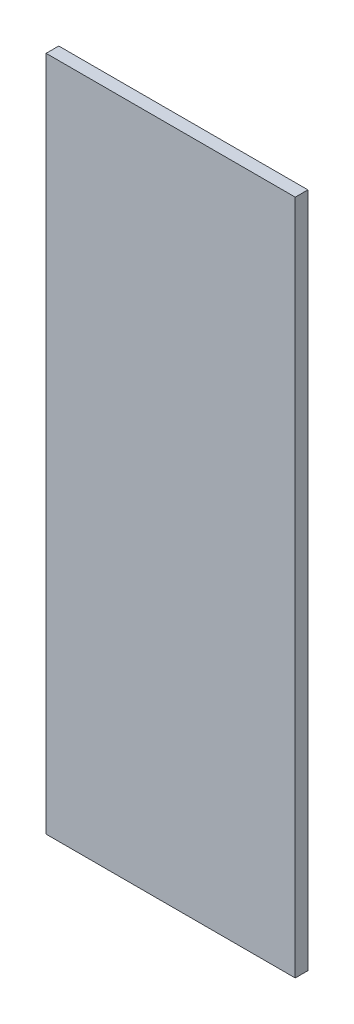
ISO-10303-21;
HEADER;
FILE_DESCRIPTION(('STEP AP214'),'2;1');
FILE_NAME('part.step','',(''),(''),'','','');
FILE_SCHEMA(('AUTOMOTIVE_DESIGN { 1 0 10303 214 1 1 1 1 }'));
ENDSEC;
DATA;
#1=APPLICATION_CONTEXT('core data for automotive mechanical design processes');
#2=APPLICATION_PROTOCOL_DEFINITION('international standard','automotive_design',2000,#1);
#3=PRODUCT_CONTEXT('',#1,'mechanical');
#4=PRODUCT('Part','Part','',(#3));
#5=PRODUCT_RELATED_PRODUCT_CATEGORY('part','',(#4));
#6=PRODUCT_DEFINITION_FORMATION('','',#4);
#7=PRODUCT_DEFINITION_CONTEXT('part definition',#1,'design');
#8=PRODUCT_DEFINITION('design','',#6,#7);
#9=PRODUCT_DEFINITION_SHAPE('','',#8);
#10=(LENGTH_UNIT() NAMED_UNIT(*) SI_UNIT(.MILLI.,.METRE.));
#11=(NAMED_UNIT(*) PLANE_ANGLE_UNIT() SI_UNIT($,.RADIAN.));
#12=(NAMED_UNIT(*) SI_UNIT($,.STERADIAN.) SOLID_ANGLE_UNIT());
#13=UNCERTAINTY_MEASURE_WITH_UNIT(LENGTH_MEASURE(1.E-05),#10,'distance_accuracy_value','');
#14=(GEOMETRIC_REPRESENTATION_CONTEXT(3) GLOBAL_UNCERTAINTY_ASSIGNED_CONTEXT((#13)) GLOBAL_UNIT_ASSIGNED_CONTEXT((#10,
#11,#12)) REPRESENTATION_CONTEXT('',''));
#15=CARTESIAN_POINT('',(0.,0.,0.));
#16=DIRECTION('',(0.,0.,1.));
#17=DIRECTION('',(1.,0.,0.));
#18=AXIS2_PLACEMENT_3D('',#15,#16,#17);
#19=CARTESIAN_POINT('',(86.6920013427734,53.8279991149902,0.));
#20=DIRECTION('',(1.,0.,0.));
#21=DIRECTION('',(0.,-1.,0.));
#22=AXIS2_PLACEMENT_3D('',#19,#20,#21);
#23=PLANE('',#22);
#24=DIRECTION('',(0.,-1.,0.));
#25=VECTOR('',#24,1.);
#26=CARTESIAN_POINT('',(86.6920013427734,53.8279991149902,0.03556));
#27=LINE('',#26,#25);
#28=CARTESIAN_POINT('',(86.6920013427734,53.8279991149902,0.03556));
#29=VERTEX_POINT('',#28);
#30=CARTESIAN_POINT('',(86.6920013427734,51.9280014038086,0.03556));
#31=VERTEX_POINT('',#30);
#32=EDGE_CURVE('E11',#29,#31,#27,.T.);
#33=ORIENTED_EDGE('',*,*,#32,.F.);
#34=DIRECTION('',(0.,0.,1.));
#35=VECTOR('',#34,1.);
#36=CARTESIAN_POINT('',(86.6920013427734,53.8279991149902,0.));
#37=LINE('',#36,#35);
#38=CARTESIAN_POINT('',(86.6920013427734,53.8279991149902,0.));
#39=VERTEX_POINT('',#38);
#40=EDGE_CURVE('E24',#39,#29,#37,.T.);
#41=ORIENTED_EDGE('',*,*,#40,.F.);
#42=DIRECTION('',(0.,-1.,0.));
#43=VECTOR('',#42,1.);
#44=CARTESIAN_POINT('',(86.6920013427734,53.8279991149902,0.));
#45=LINE('',#44,#43);
#46=CARTESIAN_POINT('',(86.6920013427734,51.9280014038086,0.));
#47=VERTEX_POINT('',#46);
#48=EDGE_CURVE('E75',#39,#47,#45,.T.);
#49=ORIENTED_EDGE('',*,*,#48,.T.);
#50=DIRECTION('',(0.,0.,1.));
#51=VECTOR('',#50,1.);
#52=CARTESIAN_POINT('',(86.6920013427734,51.9280014038086,0.));
#53=LINE('',#52,#51);
#54=EDGE_CURVE('E37',#47,#31,#53,.T.);
#55=ORIENTED_EDGE('',*,*,#54,.T.);
#56=EDGE_LOOP('',(#33,#41,#49,#55));
#57=FACE_BOUND('',#56,.T.);
#58=ADVANCED_FACE('F17',(#57),#23,.F.);
#59=CARTESIAN_POINT('',(86.6920013427734,51.9280014038086,0.));
#60=DIRECTION('',(0.,1.,0.));
#61=DIRECTION('',(1.,0.,0.));
#62=AXIS2_PLACEMENT_3D('',#59,#60,#61);
#63=PLANE('',#62);
#64=DIRECTION('',(1.,0.,0.));
#65=VECTOR('',#64,1.);
#66=CARTESIAN_POINT('',(86.6920013427734,51.9280014038086,0.03556));
#67=LINE('',#66,#65);
#68=CARTESIAN_POINT('',(87.3919982910156,51.9280014038086,0.03556));
#69=VERTEX_POINT('',#68);
#70=EDGE_CURVE('E83',#31,#69,#67,.T.);
#71=ORIENTED_EDGE('',*,*,#70,.F.);
#72=ORIENTED_EDGE('',*,*,#54,.F.);
#73=DIRECTION('',(1.,0.,0.));
#74=VECTOR('',#73,1.);
#75=CARTESIAN_POINT('',(86.6920013427734,51.9280014038086,0.));
#76=LINE('',#75,#74);
#77=CARTESIAN_POINT('',(87.3919982910156,51.9280014038086,0.));
#78=VERTEX_POINT('',#77);
#79=EDGE_CURVE('E81',#47,#78,#76,.T.);
#80=ORIENTED_EDGE('',*,*,#79,.T.);
#81=DIRECTION('',(0.,0.,1.));
#82=VECTOR('',#81,1.);
#83=CARTESIAN_POINT('',(87.3919982910156,51.9280014038086,0.));
#84=LINE('',#83,#82);
#85=EDGE_CURVE('E67',#78,#69,#84,.T.);
#86=ORIENTED_EDGE('',*,*,#85,.T.);
#87=EDGE_LOOP('',(#71,#72,#80,#86));
#88=FACE_BOUND('',#87,.T.);
#89=ADVANCED_FACE('F89',(#88),#63,.F.);
#90=CARTESIAN_POINT('',(87.3919982910156,51.9280014038086,0.));
#91=DIRECTION('',(-1.,0.,0.));
#92=DIRECTION('',(0.,1.,0.));
#93=AXIS2_PLACEMENT_3D('',#90,#91,#92);
#94=PLANE('',#93);
#95=DIRECTION('',(0.,1.,0.));
#96=VECTOR('',#95,1.);
#97=CARTESIAN_POINT('',(87.3919982910156,51.9280014038086,0.03556));
#98=LINE('',#97,#96);
#99=CARTESIAN_POINT('',(87.3919982910156,53.8279991149902,0.03556));
#100=VERTEX_POINT('',#99);
#101=EDGE_CURVE('E71',#69,#100,#98,.T.);
#102=ORIENTED_EDGE('',*,*,#101,.F.);
#103=ORIENTED_EDGE('',*,*,#85,.F.);
#104=DIRECTION('',(0.,1.,0.));
#105=VECTOR('',#104,1.);
#106=CARTESIAN_POINT('',(87.3919982910156,51.9280014038086,0.));
#107=LINE('',#106,#105);
#108=CARTESIAN_POINT('',(87.3919982910156,53.8279991149902,0.));
#109=VERTEX_POINT('',#108);
#110=EDGE_CURVE('E63',#78,#109,#107,.T.);
#111=ORIENTED_EDGE('',*,*,#110,.T.);
#112=DIRECTION('',(0.,0.,1.));
#113=VECTOR('',#112,1.);
#114=CARTESIAN_POINT('',(87.3919982910156,53.8279991149902,0.));
#115=LINE('',#114,#113);
#116=EDGE_CURVE('E53',#109,#100,#115,.T.);
#117=ORIENTED_EDGE('',*,*,#116,.T.);
#118=EDGE_LOOP('',(#102,#103,#111,#117));
#119=FACE_BOUND('',#118,.T.);
#120=ADVANCED_FACE('F66',(#119),#94,.F.);
#121=CARTESIAN_POINT('',(87.3919982910156,53.8279991149902,0.));
#122=DIRECTION('',(0.,-1.,0.));
#123=DIRECTION('',(-1.,0.,0.));
#124=AXIS2_PLACEMENT_3D('',#121,#122,#123);
#125=PLANE('',#124);
#126=DIRECTION('',(-1.,0.,0.));
#127=VECTOR('',#126,1.);
#128=CARTESIAN_POINT('',(87.3919982910156,53.8279991149902,0.03556));
#129=LINE('',#128,#127);
#130=EDGE_CURVE('E59',#100,#29,#129,.T.);
#131=ORIENTED_EDGE('',*,*,#130,.F.);
#132=ORIENTED_EDGE('',*,*,#116,.F.);
#133=DIRECTION('',(-1.,0.,0.));
#134=VECTOR('',#133,1.);
#135=CARTESIAN_POINT('',(87.3919982910156,53.8279991149902,0.));
#136=LINE('',#135,#134);
#137=EDGE_CURVE('E57',#109,#39,#136,.T.);
#138=ORIENTED_EDGE('',*,*,#137,.T.);
#139=ORIENTED_EDGE('',*,*,#40,.T.);
#140=EDGE_LOOP('',(#131,#132,#138,#139));
#141=FACE_BOUND('',#140,.T.);
#142=ADVANCED_FACE('F55',(#141),#125,.F.);
#143=CARTESIAN_POINT('',(86.6920013427734,53.8279991149902,0.));
#144=DIRECTION('',(0.,0.,-1.));
#145=DIRECTION('',(-1.,0.,0.));
#146=AXIS2_PLACEMENT_3D('',#143,#144,#145);
#147=PLANE('',#146);
#148=ORIENTED_EDGE('',*,*,#137,.F.);
#149=ORIENTED_EDGE('',*,*,#110,.F.);
#150=ORIENTED_EDGE('',*,*,#79,.F.);
#151=ORIENTED_EDGE('',*,*,#48,.F.);
#152=EDGE_LOOP('',(#148,#149,#150,#151));
#153=FACE_BOUND('',#152,.T.);
#154=ADVANCED_FACE('F74',(#153),#147,.T.);
#155=CARTESIAN_POINT('',(86.6920013427734,53.8279991149902,0.03556));
#156=DIRECTION('',(0.,0.,-1.));
#157=DIRECTION('',(-1.,0.,0.));
#158=AXIS2_PLACEMENT_3D('',#155,#156,#157);
#159=PLANE('',#158);
#160=ORIENTED_EDGE('',*,*,#32,.T.);
#161=ORIENTED_EDGE('',*,*,#70,.T.);
#162=ORIENTED_EDGE('',*,*,#101,.T.);
#163=ORIENTED_EDGE('',*,*,#130,.T.);
#164=EDGE_LOOP('',(#160,#161,#162,#163));
#165=FACE_BOUND('',#164,.T.);
#166=ADVANCED_FACE('F91',(#165),#159,.F.);
#167=CLOSED_SHELL('',(#58,#89,#120,#142,#154,#166));
#168=MANIFOLD_SOLID_BREP('B1',#167);
#169=ADVANCED_BREP_SHAPE_REPRESENTATION('',(#18,#168),#14);
#170=SHAPE_DEFINITION_REPRESENTATION(#9,#169);
ENDSEC;
END-ISO-10303-21;
